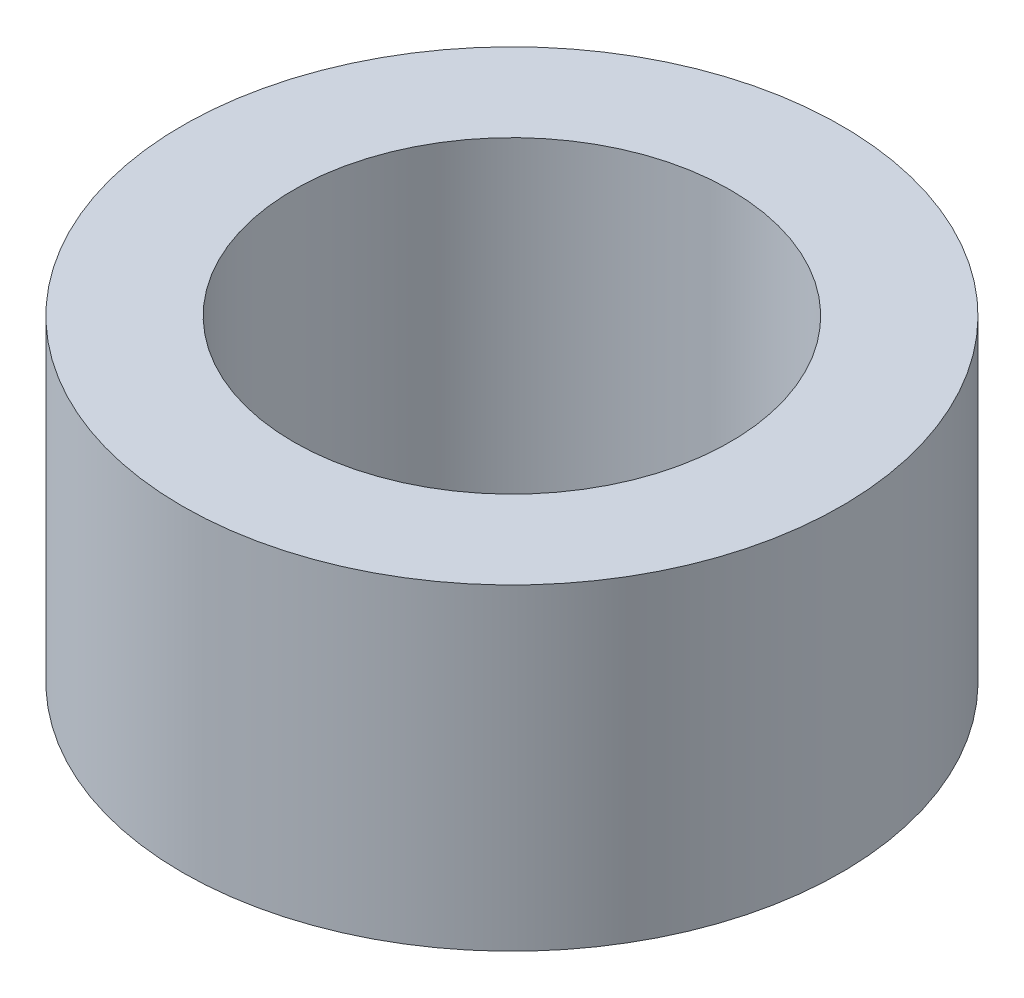
ISO-10303-21;
HEADER;
FILE_DESCRIPTION(('STEP AP214'),'2;1');
FILE_NAME('part.step','',(''),(''),'','','');
FILE_SCHEMA(('AUTOMOTIVE_DESIGN { 1 0 10303 214 1 1 1 1 }'));
ENDSEC;
DATA;
#1=APPLICATION_CONTEXT('core data for automotive mechanical design processes');
#2=APPLICATION_PROTOCOL_DEFINITION('international standard','automotive_design',2000,#1);
#3=PRODUCT_CONTEXT('',#1,'mechanical');
#4=PRODUCT('Part','Part','',(#3));
#5=PRODUCT_RELATED_PRODUCT_CATEGORY('part','',(#4));
#6=PRODUCT_DEFINITION_FORMATION('','',#4);
#7=PRODUCT_DEFINITION_CONTEXT('part definition',#1,'design');
#8=PRODUCT_DEFINITION('design','',#6,#7);
#9=PRODUCT_DEFINITION_SHAPE('','',#8);
#10=(LENGTH_UNIT() NAMED_UNIT(*) SI_UNIT(.MILLI.,.METRE.));
#11=(NAMED_UNIT(*) PLANE_ANGLE_UNIT() SI_UNIT($,.RADIAN.));
#12=(NAMED_UNIT(*) SI_UNIT($,.STERADIAN.) SOLID_ANGLE_UNIT());
#13=UNCERTAINTY_MEASURE_WITH_UNIT(LENGTH_MEASURE(1.E-05),#10,'distance_accuracy_value','');
#14=(GEOMETRIC_REPRESENTATION_CONTEXT(3) GLOBAL_UNCERTAINTY_ASSIGNED_CONTEXT((#13)) GLOBAL_UNIT_ASSIGNED_CONTEXT((#10,
#11,#12)) REPRESENTATION_CONTEXT('',''));
#15=CARTESIAN_POINT('',(0.,0.,0.));
#16=DIRECTION('',(0.,0.,1.));
#17=DIRECTION('',(1.,0.,0.));
#18=AXIS2_PLACEMENT_3D('',#15,#16,#17);
#19=CARTESIAN_POINT('',(0.,3.85,0.));
#20=DIRECTION('',(0.,1.,0.));
#21=DIRECTION('',(0.,0.,1.));
#22=AXIS2_PLACEMENT_3D('',#19,#20,#21);
#23=PLANE('',#22);
#24=CARTESIAN_POINT('',(0.,3.85,0.));
#25=DIRECTION('',(0.,1.,0.));
#26=DIRECTION('',(0.,0.,1.));
#27=AXIS2_PLACEMENT_3D('',#24,#25,#26);
#28=CIRCLE('',#27,4.);
#29=CARTESIAN_POINT('',(0.,3.85,4.));
#30=VERTEX_POINT('',#29);
#31=EDGE_CURVE('E10',#30,#30,#28,.T.);
#32=ORIENTED_EDGE('',*,*,#31,.T.);
#33=EDGE_LOOP('',(#32));
#34=FACE_BOUND('',#33,.T.);
#35=CARTESIAN_POINT('',(0.,3.85,0.));
#36=DIRECTION('',(0.,1.,0.));
#37=DIRECTION('',(0.,0.,1.));
#38=AXIS2_PLACEMENT_3D('',#35,#36,#37);
#39=CIRCLE('',#38,2.65);
#40=CARTESIAN_POINT('',(0.,3.85,2.65));
#41=VERTEX_POINT('',#40);
#42=EDGE_CURVE('E42',#41,#41,#39,.T.);
#43=ORIENTED_EDGE('',*,*,#42,.F.);
#44=EDGE_LOOP('',(#43));
#45=FACE_BOUND('',#44,.T.);
#46=ADVANCED_FACE('F31',(#34,#45),#23,.T.);
#47=CARTESIAN_POINT('',(0.,0.,0.));
#48=DIRECTION('',(0.,1.,0.));
#49=DIRECTION('',(0.,0.,1.));
#50=AXIS2_PLACEMENT_3D('',#47,#48,#49);
#51=PLANE('',#50);
#52=CARTESIAN_POINT('',(0.,0.,0.));
#53=DIRECTION('',(0.,1.,0.));
#54=DIRECTION('',(0.,0.,1.));
#55=AXIS2_PLACEMENT_3D('',#52,#53,#54);
#56=CIRCLE('',#55,4.);
#57=CARTESIAN_POINT('',(0.,0.,4.));
#58=VERTEX_POINT('',#57);
#59=EDGE_CURVE('E35',#58,#58,#56,.T.);
#60=ORIENTED_EDGE('',*,*,#59,.F.);
#61=EDGE_LOOP('',(#60));
#62=FACE_BOUND('',#61,.T.);
#63=CARTESIAN_POINT('',(0.,0.,0.));
#64=DIRECTION('',(0.,1.,0.));
#65=DIRECTION('',(0.,0.,1.));
#66=AXIS2_PLACEMENT_3D('',#63,#64,#65);
#67=CIRCLE('',#66,2.65);
#68=CARTESIAN_POINT('',(0.,0.,2.65));
#69=VERTEX_POINT('',#68);
#70=EDGE_CURVE('E44',#69,#69,#67,.T.);
#71=ORIENTED_EDGE('',*,*,#70,.T.);
#72=EDGE_LOOP('',(#71));
#73=FACE_BOUND('',#72,.T.);
#74=ADVANCED_FACE('F54',(#62,#73),#51,.F.);
#75=CARTESIAN_POINT('',(0.,3.85,0.));
#76=DIRECTION('',(0.,-1.,0.));
#77=DIRECTION('',(0.,0.,-1.));
#78=AXIS2_PLACEMENT_3D('',#75,#76,#77);
#79=CYLINDRICAL_SURFACE('',#78,4.);
#80=ORIENTED_EDGE('',*,*,#31,.F.);
#81=EDGE_LOOP('',(#80));
#82=FACE_BOUND('',#81,.T.);
#83=ORIENTED_EDGE('',*,*,#59,.T.);
#84=EDGE_LOOP('',(#83));
#85=FACE_BOUND('',#84,.T.);
#86=ADVANCED_FACE('F33',(#82,#85),#79,.T.);
#87=CARTESIAN_POINT('',(0.,3.85,0.));
#88=DIRECTION('',(0.,-1.,0.));
#89=DIRECTION('',(0.,0.,-1.));
#90=AXIS2_PLACEMENT_3D('',#87,#88,#89);
#91=CYLINDRICAL_SURFACE('',#90,2.65);
#92=ORIENTED_EDGE('',*,*,#42,.T.);
#93=EDGE_LOOP('',(#92));
#94=FACE_BOUND('',#93,.T.);
#95=ORIENTED_EDGE('',*,*,#70,.F.);
#96=EDGE_LOOP('',(#95));
#97=FACE_BOUND('',#96,.T.);
#98=ADVANCED_FACE('F50',(#94,#97),#91,.F.);
#99=CLOSED_SHELL('',(#46,#74,#86,#98));
#100=MANIFOLD_SOLID_BREP('B2',#99);
#101=ADVANCED_BREP_SHAPE_REPRESENTATION('',(#18,#100),#14);
#102=SHAPE_DEFINITION_REPRESENTATION(#9,#101);
ENDSEC;
END-ISO-10303-21;
